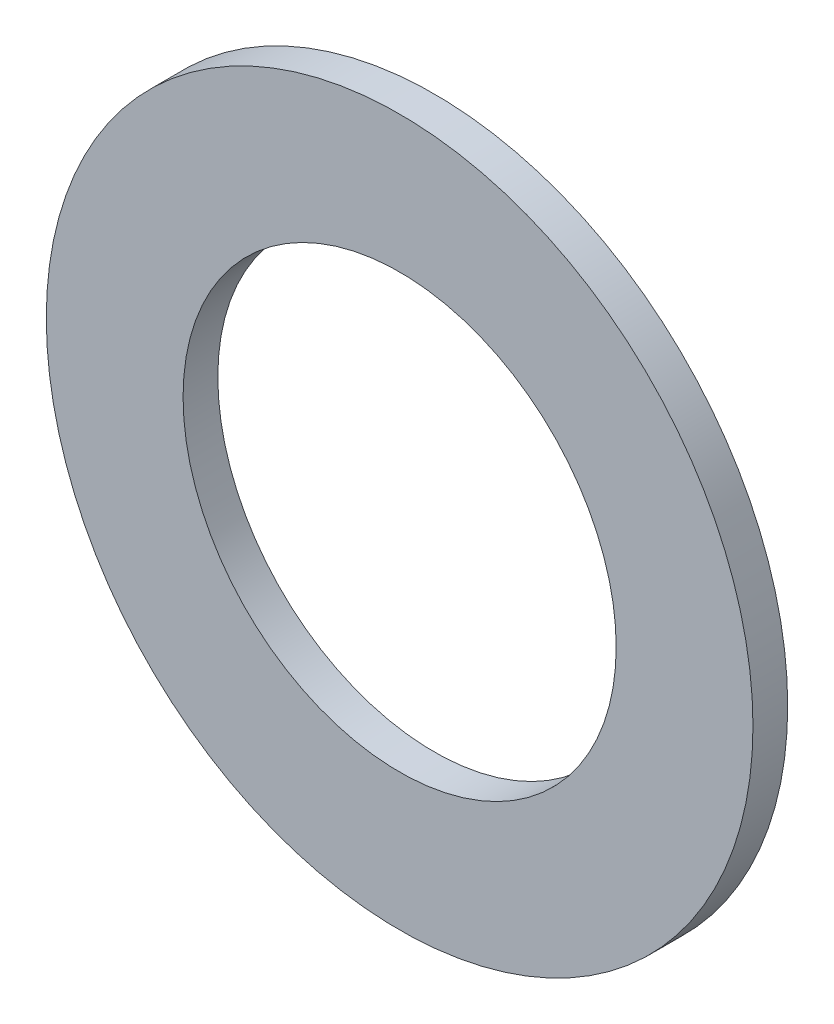
ISO-10303-21;
HEADER;
FILE_DESCRIPTION(('STEP AP214'),'2;1');
FILE_NAME('part.step','',(''),(''),'','','');
FILE_SCHEMA(('AUTOMOTIVE_DESIGN { 1 0 10303 214 1 1 1 1 }'));
ENDSEC;
DATA;
#1=APPLICATION_CONTEXT('core data for automotive mechanical design processes');
#2=APPLICATION_PROTOCOL_DEFINITION('international standard','automotive_design',2000,#1);
#3=PRODUCT_CONTEXT('',#1,'mechanical');
#4=PRODUCT('Part','Part','',(#3));
#5=PRODUCT_RELATED_PRODUCT_CATEGORY('part','',(#4));
#6=PRODUCT_DEFINITION_FORMATION('','',#4);
#7=PRODUCT_DEFINITION_CONTEXT('part definition',#1,'design');
#8=PRODUCT_DEFINITION('design','',#6,#7);
#9=PRODUCT_DEFINITION_SHAPE('','',#8);
#10=(LENGTH_UNIT() NAMED_UNIT(*) SI_UNIT(.MILLI.,.METRE.));
#11=(NAMED_UNIT(*) PLANE_ANGLE_UNIT() SI_UNIT($,.RADIAN.));
#12=(NAMED_UNIT(*) SI_UNIT($,.STERADIAN.) SOLID_ANGLE_UNIT());
#13=UNCERTAINTY_MEASURE_WITH_UNIT(LENGTH_MEASURE(1.E-05),#10,'distance_accuracy_value','');
#14=(GEOMETRIC_REPRESENTATION_CONTEXT(3) GLOBAL_UNCERTAINTY_ASSIGNED_CONTEXT((#13)) GLOBAL_UNIT_ASSIGNED_CONTEXT((#10,
#11,#12)) REPRESENTATION_CONTEXT('',''));
#15=CARTESIAN_POINT('',(0.,0.,0.));
#16=DIRECTION('',(0.,0.,1.));
#17=DIRECTION('',(1.,0.,0.));
#18=AXIS2_PLACEMENT_3D('',#15,#16,#17);
#19=CARTESIAN_POINT('',(0.,0.,0.));
#20=DIRECTION('',(0.,0.,1.));
#21=DIRECTION('',(1.,0.,0.));
#22=AXIS2_PLACEMENT_3D('',#19,#20,#21);
#23=PLANE('',#22);
#24=CARTESIAN_POINT('',(0.,0.,0.));
#25=DIRECTION('',(0.,0.,-1.));
#26=DIRECTION('',(-1.,0.,0.));
#27=AXIS2_PLACEMENT_3D('',#24,#25,#26);
#28=CIRCLE('',#27,9.5);
#29=CARTESIAN_POINT('',(-9.5,0.,0.));
#30=VERTEX_POINT('',#29);
#31=EDGE_CURVE('E27',#30,#30,#28,.F.);
#32=ORIENTED_EDGE('',*,*,#31,.T.);
#33=EDGE_LOOP('',(#32));
#34=FACE_BOUND('',#33,.T.);
#35=CARTESIAN_POINT('',(0.,0.,0.));
#36=DIRECTION('',(0.,0.,-1.));
#37=DIRECTION('',(-1.,0.,0.));
#38=AXIS2_PLACEMENT_3D('',#35,#36,#37);
#39=CIRCLE('',#38,15.5);
#40=CARTESIAN_POINT('',(-15.5,0.,0.));
#41=VERTEX_POINT('',#40);
#42=EDGE_CURVE('E18',#41,#41,#39,.F.);
#43=ORIENTED_EDGE('',*,*,#42,.F.);
#44=EDGE_LOOP('',(#43));
#45=FACE_BOUND('',#44,.T.);
#46=ADVANCED_FACE('F15',(#34,#45),#23,.F.);
#47=CARTESIAN_POINT('',(0.,0.,1.524));
#48=DIRECTION('',(0.,0.,-1.));
#49=DIRECTION('',(-1.,0.,0.));
#50=AXIS2_PLACEMENT_3D('',#47,#48,#49);
#51=CYLINDRICAL_SURFACE('',#50,15.5);
#52=ORIENTED_EDGE('',*,*,#42,.T.);
#53=EDGE_LOOP('',(#52));
#54=FACE_BOUND('',#53,.T.);
#55=CARTESIAN_POINT('',(0.,0.,1.524));
#56=DIRECTION('',(0.,0.,-1.));
#57=DIRECTION('',(-1.,0.,0.));
#58=AXIS2_PLACEMENT_3D('',#55,#56,#57);
#59=CIRCLE('',#58,15.5);
#60=CARTESIAN_POINT('',(-15.5,0.,1.524));
#61=VERTEX_POINT('',#60);
#62=EDGE_CURVE('E22',#61,#61,#59,.F.);
#63=ORIENTED_EDGE('',*,*,#62,.F.);
#64=EDGE_LOOP('',(#63));
#65=FACE_BOUND('',#64,.T.);
#66=ADVANCED_FACE('F35',(#54,#65),#51,.T.);
#67=CARTESIAN_POINT('',(0.,0.,1.524));
#68=DIRECTION('',(0.,0.,-1.));
#69=DIRECTION('',(-1.,0.,0.));
#70=AXIS2_PLACEMENT_3D('',#67,#68,#69);
#71=CYLINDRICAL_SURFACE('',#70,9.5);
#72=CARTESIAN_POINT('',(0.,0.,1.524));
#73=DIRECTION('',(0.,0.,-1.));
#74=DIRECTION('',(-1.,0.,0.));
#75=AXIS2_PLACEMENT_3D('',#72,#73,#74);
#76=CIRCLE('',#75,9.5);
#77=CARTESIAN_POINT('',(-9.5,0.,1.524));
#78=VERTEX_POINT('',#77);
#79=EDGE_CURVE('E10',#78,#78,#76,.T.);
#80=ORIENTED_EDGE('',*,*,#79,.F.);
#81=EDGE_LOOP('',(#80));
#82=FACE_BOUND('',#81,.T.);
#83=ORIENTED_EDGE('',*,*,#31,.F.);
#84=EDGE_LOOP('',(#83));
#85=FACE_BOUND('',#84,.T.);
#86=ADVANCED_FACE('F43',(#82,#85),#71,.F.);
#87=CARTESIAN_POINT('',(0.,0.,1.524));
#88=DIRECTION('',(0.,0.,1.));
#89=DIRECTION('',(1.,0.,0.));
#90=AXIS2_PLACEMENT_3D('',#87,#88,#89);
#91=PLANE('',#90);
#92=ORIENTED_EDGE('',*,*,#79,.T.);
#93=EDGE_LOOP('',(#92));
#94=FACE_BOUND('',#93,.T.);
#95=ORIENTED_EDGE('',*,*,#62,.T.);
#96=EDGE_LOOP('',(#95));
#97=FACE_BOUND('',#96,.T.);
#98=ADVANCED_FACE('F44',(#94,#97),#91,.T.);
#99=CLOSED_SHELL('',(#46,#66,#86,#98));
#100=MANIFOLD_SOLID_BREP('B1',#99);
#101=ADVANCED_BREP_SHAPE_REPRESENTATION('',(#18,#100),#14);
#102=SHAPE_DEFINITION_REPRESENTATION(#9,#101);
ENDSEC;
END-ISO-10303-21;
